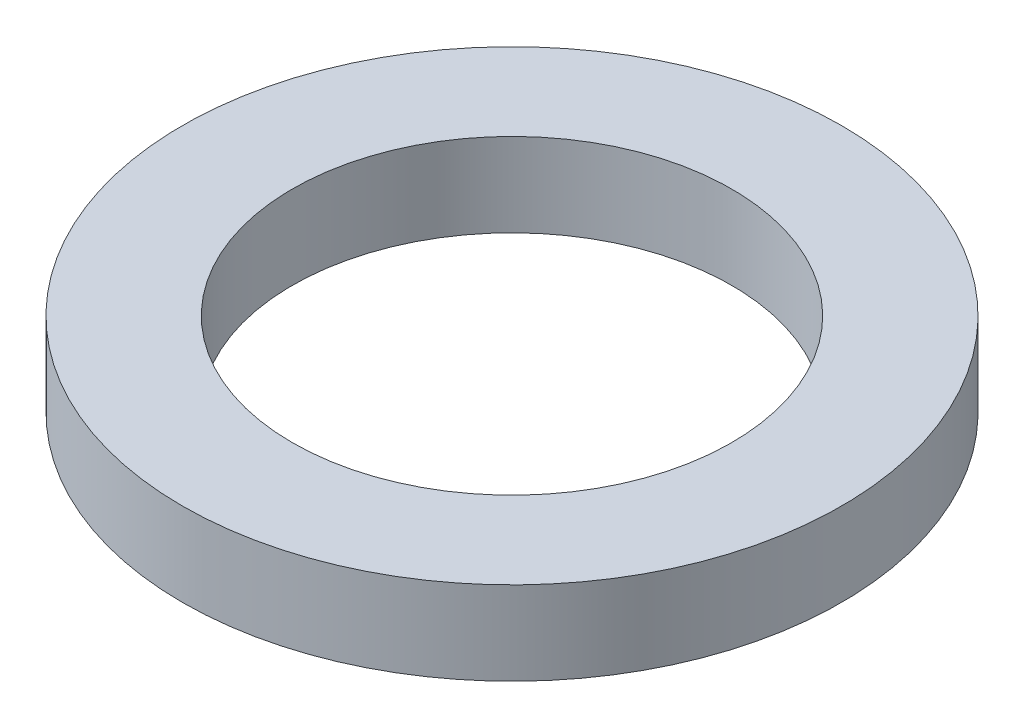
ISO-10303-21;
HEADER;
FILE_DESCRIPTION(('STEP AP214'),'2;1');
FILE_NAME('part.step','',(''),(''),'','','');
FILE_SCHEMA(('AUTOMOTIVE_DESIGN { 1 0 10303 214 1 1 1 1 }'));
ENDSEC;
DATA;
#1=APPLICATION_CONTEXT('core data for automotive mechanical design processes');
#2=APPLICATION_PROTOCOL_DEFINITION('international standard','automotive_design',2000,#1);
#3=PRODUCT_CONTEXT('',#1,'mechanical');
#4=PRODUCT('Part','Part','',(#3));
#5=PRODUCT_RELATED_PRODUCT_CATEGORY('part','',(#4));
#6=PRODUCT_DEFINITION_FORMATION('','',#4);
#7=PRODUCT_DEFINITION_CONTEXT('part definition',#1,'design');
#8=PRODUCT_DEFINITION('design','',#6,#7);
#9=PRODUCT_DEFINITION_SHAPE('','',#8);
#10=(LENGTH_UNIT() NAMED_UNIT(*) SI_UNIT(.MILLI.,.METRE.));
#11=(NAMED_UNIT(*) PLANE_ANGLE_UNIT() SI_UNIT($,.RADIAN.));
#12=(NAMED_UNIT(*) SI_UNIT($,.STERADIAN.) SOLID_ANGLE_UNIT());
#13=UNCERTAINTY_MEASURE_WITH_UNIT(LENGTH_MEASURE(1.E-05),#10,'distance_accuracy_value','');
#14=(GEOMETRIC_REPRESENTATION_CONTEXT(3) GLOBAL_UNCERTAINTY_ASSIGNED_CONTEXT((#13)) GLOBAL_UNIT_ASSIGNED_CONTEXT((#10,
#11,#12)) REPRESENTATION_CONTEXT('',''));
#15=CARTESIAN_POINT('',(0.,0.,0.));
#16=DIRECTION('',(0.,0.,1.));
#17=DIRECTION('',(1.,0.,0.));
#18=AXIS2_PLACEMENT_3D('',#15,#16,#17);
#19=CARTESIAN_POINT('',(0.,19.,0.));
#20=DIRECTION('',(0.,-1.,0.));
#21=DIRECTION('',(0.,0.,-1.));
#22=AXIS2_PLACEMENT_3D('',#19,#20,#21);
#23=CYLINDRICAL_SURFACE('',#22,75.);
#24=CARTESIAN_POINT('',(0.,19.,0.));
#25=DIRECTION('',(0.,1.,0.));
#26=DIRECTION('',(0.,0.,1.));
#27=AXIS2_PLACEMENT_3D('',#24,#25,#26);
#28=CIRCLE('',#27,75.);
#29=CARTESIAN_POINT('',(0.,19.,75.));
#30=VERTEX_POINT('',#29);
#31=EDGE_CURVE('E10',#30,#30,#28,.T.);
#32=ORIENTED_EDGE('',*,*,#31,.F.);
#33=EDGE_LOOP('',(#32));
#34=FACE_BOUND('',#33,.T.);
#35=CARTESIAN_POINT('',(0.,0.,0.));
#36=DIRECTION('',(0.,1.,0.));
#37=DIRECTION('',(0.,0.,1.));
#38=AXIS2_PLACEMENT_3D('',#35,#36,#37);
#39=CIRCLE('',#38,75.);
#40=CARTESIAN_POINT('',(0.,0.,75.));
#41=VERTEX_POINT('',#40);
#42=EDGE_CURVE('E37',#41,#41,#39,.T.);
#43=ORIENTED_EDGE('',*,*,#42,.T.);
#44=EDGE_LOOP('',(#43));
#45=FACE_BOUND('',#44,.T.);
#46=ADVANCED_FACE('F40',(#34,#45),#23,.T.);
#47=CARTESIAN_POINT('',(0.,19.,0.));
#48=DIRECTION('',(0.,1.,0.));
#49=DIRECTION('',(0.,0.,1.));
#50=AXIS2_PLACEMENT_3D('',#47,#48,#49);
#51=PLANE('',#50);
#52=CARTESIAN_POINT('',(0.,19.,0.));
#53=DIRECTION('',(0.,1.,0.));
#54=DIRECTION('',(0.,0.,1.));
#55=AXIS2_PLACEMENT_3D('',#52,#53,#54);
#56=CIRCLE('',#55,50.);
#57=CARTESIAN_POINT('',(0.,19.,50.));
#58=VERTEX_POINT('',#57);
#59=EDGE_CURVE('E50',#58,#58,#56,.T.);
#60=ORIENTED_EDGE('',*,*,#59,.F.);
#61=EDGE_LOOP('',(#60));
#62=FACE_BOUND('',#61,.T.);
#63=ORIENTED_EDGE('',*,*,#31,.T.);
#64=EDGE_LOOP('',(#63));
#65=FACE_BOUND('',#64,.T.);
#66=ADVANCED_FACE('F59',(#62,#65),#51,.T.);
#67=CARTESIAN_POINT('',(0.,0.,0.));
#68=DIRECTION('',(0.,1.,0.));
#69=DIRECTION('',(0.,0.,1.));
#70=AXIS2_PLACEMENT_3D('',#67,#68,#69);
#71=PLANE('',#70);
#72=CARTESIAN_POINT('',(0.,0.,0.));
#73=DIRECTION('',(0.,1.,0.));
#74=DIRECTION('',(0.,0.,1.));
#75=AXIS2_PLACEMENT_3D('',#72,#73,#74);
#76=CIRCLE('',#75,50.);
#77=CARTESIAN_POINT('',(0.,0.,50.));
#78=VERTEX_POINT('',#77);
#79=EDGE_CURVE('E47',#78,#78,#76,.T.);
#80=ORIENTED_EDGE('',*,*,#79,.T.);
#81=EDGE_LOOP('',(#80));
#82=FACE_BOUND('',#81,.T.);
#83=ORIENTED_EDGE('',*,*,#42,.F.);
#84=EDGE_LOOP('',(#83));
#85=FACE_BOUND('',#84,.T.);
#86=ADVANCED_FACE('F58',(#82,#85),#71,.F.);
#87=CARTESIAN_POINT('',(0.,19.,0.));
#88=DIRECTION('',(0.,-1.,0.));
#89=DIRECTION('',(0.,0.,-1.));
#90=AXIS2_PLACEMENT_3D('',#87,#88,#89);
#91=CYLINDRICAL_SURFACE('',#90,50.);
#92=ORIENTED_EDGE('',*,*,#59,.T.);
#93=EDGE_LOOP('',(#92));
#94=FACE_BOUND('',#93,.T.);
#95=ORIENTED_EDGE('',*,*,#79,.F.);
#96=EDGE_LOOP('',(#95));
#97=FACE_BOUND('',#96,.T.);
#98=ADVANCED_FACE('F54',(#94,#97),#91,.F.);
#99=CLOSED_SHELL('',(#46,#66,#86,#98));
#100=MANIFOLD_SOLID_BREP('B2',#99);
#101=ADVANCED_BREP_SHAPE_REPRESENTATION('',(#18,#100),#14);
#102=SHAPE_DEFINITION_REPRESENTATION(#9,#101);
ENDSEC;
END-ISO-10303-21;
